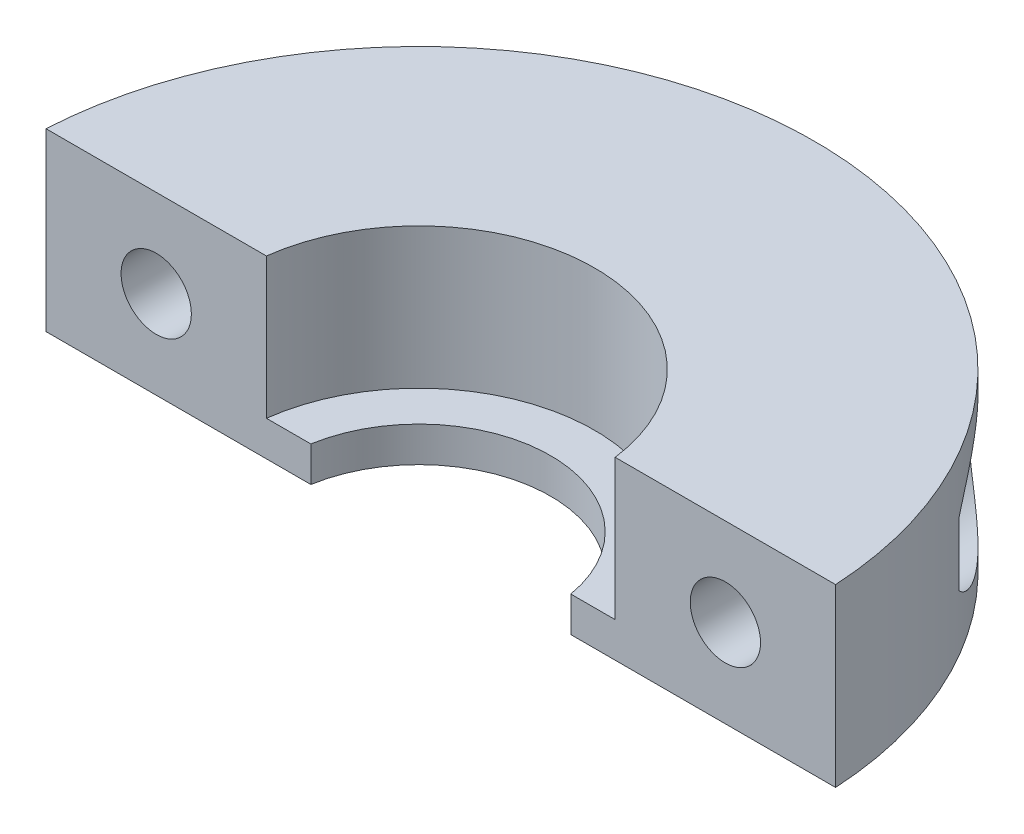
ISO-10303-21;
HEADER;
FILE_DESCRIPTION(('STEP AP214'),'2;1');
FILE_NAME('part.step','',(''),(''),'','','');
FILE_SCHEMA(('AUTOMOTIVE_DESIGN { 1 0 10303 214 1 1 1 1 }'));
ENDSEC;
DATA;
#1=APPLICATION_CONTEXT('core data for automotive mechanical design processes');
#2=APPLICATION_PROTOCOL_DEFINITION('international standard','automotive_design',2000,#1);
#3=PRODUCT_CONTEXT('',#1,'mechanical');
#4=PRODUCT('Part','Part','',(#3));
#5=PRODUCT_RELATED_PRODUCT_CATEGORY('part','',(#4));
#6=PRODUCT_DEFINITION_FORMATION('','',#4);
#7=PRODUCT_DEFINITION_CONTEXT('part definition',#1,'design');
#8=PRODUCT_DEFINITION('design','',#6,#7);
#9=PRODUCT_DEFINITION_SHAPE('','',#8);
#10=(LENGTH_UNIT() NAMED_UNIT(*) SI_UNIT(.MILLI.,.METRE.));
#11=(NAMED_UNIT(*) PLANE_ANGLE_UNIT() SI_UNIT($,.RADIAN.));
#12=(NAMED_UNIT(*) SI_UNIT($,.STERADIAN.) SOLID_ANGLE_UNIT());
#13=UNCERTAINTY_MEASURE_WITH_UNIT(LENGTH_MEASURE(1.E-05),#10,'distance_accuracy_value','');
#14=(GEOMETRIC_REPRESENTATION_CONTEXT(3) GLOBAL_UNCERTAINTY_ASSIGNED_CONTEXT((#13)) GLOBAL_UNIT_ASSIGNED_CONTEXT((#10,
#11,#12)) REPRESENTATION_CONTEXT('',''));
#15=CARTESIAN_POINT('',(0.,0.,0.));
#16=DIRECTION('',(0.,0.,1.));
#17=DIRECTION('',(1.,0.,0.));
#18=AXIS2_PLACEMENT_3D('',#15,#16,#17);
#19=CARTESIAN_POINT('',(0.,8.,0.));
#20=DIRECTION('',(0.,1.,0.));
#21=DIRECTION('',(0.,0.,1.));
#22=AXIS2_PLACEMENT_3D('',#19,#20,#21);
#23=PLANE('',#22);
#24=DIRECTION('',(-1.,0.,0.));
#25=VECTOR('',#24,1.);
#26=CARTESIAN_POINT('',(-20.,8.,-1.));
#27=LINE('',#26,#25);
#28=CARTESIAN_POINT('',(17.9722007556114,8.,-1.));
#29=VERTEX_POINT('',#28);
#30=CARTESIAN_POINT('',(7.93725393319377,8.,-1.));
#31=VERTEX_POINT('',#30);
#32=EDGE_CURVE('E187',#29,#31,#27,.T.);
#33=ORIENTED_EDGE('',*,*,#32,.F.);
#34=CARTESIAN_POINT('',(0.,8.,0.));
#35=DIRECTION('',(0.,1.,0.));
#36=DIRECTION('',(0.,0.,1.));
#37=AXIS2_PLACEMENT_3D('',#34,#35,#36);
#38=CIRCLE('',#37,18.);
#39=CARTESIAN_POINT('',(-17.9722007556114,8.,-1.));
#40=VERTEX_POINT('',#39);
#41=EDGE_CURVE('E212',#29,#40,#38,.T.);
#42=ORIENTED_EDGE('',*,*,#41,.T.);
#43=CARTESIAN_POINT('',(-7.93725393319377,8.,-1.));
#44=VERTEX_POINT('',#43);
#45=EDGE_CURVE('E182',#44,#40,#27,.T.);
#46=ORIENTED_EDGE('',*,*,#45,.F.);
#47=CARTESIAN_POINT('',(0.,8.,0.));
#48=DIRECTION('',(0.,1.,0.));
#49=DIRECTION('',(0.,0.,1.));
#50=AXIS2_PLACEMENT_3D('',#47,#48,#49);
#51=CIRCLE('',#50,8.);
#52=EDGE_CURVE('E206',#31,#44,#51,.T.);
#53=ORIENTED_EDGE('',*,*,#52,.F.);
#54=EDGE_LOOP('',(#33,#42,#46,#53));
#55=FACE_BOUND('',#54,.T.);
#56=ADVANCED_FACE('F32',(#55),#23,.T.);
#57=CARTESIAN_POINT('',(0.,0.,0.));
#58=DIRECTION('',(0.,1.,0.));
#59=DIRECTION('',(0.,0.,1.));
#60=AXIS2_PLACEMENT_3D('',#57,#58,#59);
#61=PLANE('',#60);
#62=CARTESIAN_POINT('',(0.,0.,0.));
#63=DIRECTION('',(0.,1.,0.));
#64=DIRECTION('',(0.,0.,1.));
#65=AXIS2_PLACEMENT_3D('',#62,#63,#64);
#66=CIRCLE('',#65,18.);
#67=CARTESIAN_POINT('',(17.9722007556114,0.,-1.));
#68=VERTEX_POINT('',#67);
#69=CARTESIAN_POINT('',(-17.9722007556114,0.,-1.));
#70=VERTEX_POINT('',#69);
#71=EDGE_CURVE('E211',#68,#70,#66,.T.);
#72=ORIENTED_EDGE('',*,*,#71,.F.);
#73=DIRECTION('',(-1.,0.,0.));
#74=VECTOR('',#73,1.);
#75=CARTESIAN_POINT('',(-20.,0.,-1.));
#76=LINE('',#75,#74);
#77=CARTESIAN_POINT('',(5.91607978309962,0.,-1.));
#78=VERTEX_POINT('',#77);
#79=EDGE_CURVE('E186',#68,#78,#76,.T.);
#80=ORIENTED_EDGE('',*,*,#79,.T.);
#81=CARTESIAN_POINT('',(0.,0.,0.));
#82=DIRECTION('',(0.,1.,0.));
#83=DIRECTION('',(0.,0.,1.));
#84=AXIS2_PLACEMENT_3D('',#81,#82,#83);
#85=CIRCLE('',#84,6.);
#86=CARTESIAN_POINT('',(-5.91607978309962,0.,-1.));
#87=VERTEX_POINT('',#86);
#88=EDGE_CURVE('E202',#78,#87,#85,.T.);
#89=ORIENTED_EDGE('',*,*,#88,.T.);
#90=EDGE_CURVE('E183',#87,#70,#76,.T.);
#91=ORIENTED_EDGE('',*,*,#90,.T.);
#92=EDGE_LOOP('',(#72,#80,#89,#91));
#93=FACE_BOUND('',#92,.T.);
#94=ADVANCED_FACE('F124',(#93),#61,.F.);
#95=CARTESIAN_POINT('',(0.,8.,0.));
#96=DIRECTION('',(0.,-1.,0.));
#97=DIRECTION('',(0.,0.,-1.));
#98=AXIS2_PLACEMENT_3D('',#95,#96,#97);
#99=CYLINDRICAL_SURFACE('',#98,18.);
#100=DIRECTION('',(0.,-1.,0.));
#101=VECTOR('',#100,1.);
#102=CARTESIAN_POINT('',(15.5884572681199,8.,-9.));
#103=LINE('',#102,#101);
#104=CARTESIAN_POINT('',(15.5884572681199,5.43647718008887,-9.));
#105=VERTEX_POINT('',#104);
#106=CARTESIAN_POINT('',(15.5884572681199,2.56352281991113,-9.));
#107=VERTEX_POINT('',#106);
#108=EDGE_CURVE('E100',#105,#107,#103,.T.);
#109=ORIENTED_EDGE('',*,*,#108,.F.);
#110=CARTESIAN_POINT('',(15.5884572681199,2.56352281991113,-9.));
#111=CARTESIAN_POINT('',(15.5649651770552,2.52046222519624,-9.04069159192705));
#112=CARTESIAN_POINT('',(15.5407733203554,2.47860756697143,-9.08222295354555));
#113=CARTESIAN_POINT('',(15.4911048788267,2.39716814864524,-9.1666820942712));
#114=CARTESIAN_POINT('',(15.465628835948,2.35758244582849,-9.20960928164386));
#115=CARTESIAN_POINT('',(15.3875216072785,2.24211958036131,-9.33993643477878));
#116=CARTESIAN_POINT('',(15.3331153979724,2.16936371164468,-9.42904881982839));
#117=CARTESIAN_POINT('',(15.2202507440993,2.03141446708927,-9.61016905731066));
#118=CARTESIAN_POINT('',(15.1617986315061,1.96620968278379,-9.7021722675498));
#119=CARTESIAN_POINT('',(15.0410785220971,1.84254664328878,-9.88828999513382));
#120=CARTESIAN_POINT('',(14.9788077084984,1.78409346218517,-9.9824060377223));
#121=CARTESIAN_POINT('',(14.8162589210875,1.6438056376647,-10.2229835183654));
#122=CARTESIAN_POINT('',(14.7135607548742,1.5663157950125,-10.3703591344364));
#123=CARTESIAN_POINT('',(14.5004236316084,1.42568226063934,-10.6663496453093));
#124=CARTESIAN_POINT('',(14.3899831070043,1.36254148513302,-10.8149647856733));
#125=CARTESIAN_POINT('',(14.1615166864593,1.25047440723539,-11.1124577672634));
#126=CARTESIAN_POINT('',(14.0434702759297,1.20158869619187,-11.2613351672845));
#127=CARTESIAN_POINT('',(13.8005951287262,1.11886190396239,-11.5576924577582));
#128=CARTESIAN_POINT('',(13.6757684369314,1.08501631475726,-11.7051727539801));
#129=CARTESIAN_POINT('',(13.44636842676,1.03874935894294,-11.9674124398081));
#130=CARTESIAN_POINT('',(13.3429307767608,1.02334830990902,-12.0826442178997));
#131=CARTESIAN_POINT('',(13.1326326985348,1.00341798940374,-12.310890554039));
#132=CARTESIAN_POINT('',(13.0257729845453,0.998886464090378,-12.423905566921));
#133=CARTESIAN_POINT('',(12.8094726149605,1.00157246187083,-12.646796159113));
#134=CARTESIAN_POINT('',(12.7000389864422,1.00876099166657,-12.7566788035054));
#135=CARTESIAN_POINT('',(12.4792132271642,1.03583773328365,-12.9727840347959));
#136=CARTESIAN_POINT('',(12.3678217182956,1.05572198094079,-13.0790077532644));
#137=CARTESIAN_POINT('',(12.0906341502741,1.12211137622996,-13.3366909955897));
#138=CARTESIAN_POINT('',(11.9242462037354,1.17679255479843,-13.485543571334));
#139=CARTESIAN_POINT('',(11.5946164625392,1.3200201914222,-13.7699714509366));
#140=CARTESIAN_POINT('',(11.4313716396406,1.40853214348646,-13.9055601070489));
#141=CARTESIAN_POINT('',(11.1468891493214,1.60102042177289,-14.1341204820303));
#142=CARTESIAN_POINT('',(11.0237407784989,1.69844948936693,-14.2302113736173));
#143=CARTESIAN_POINT('',(10.7893013606776,1.91755640908782,-14.4087689272405));
#144=CARTESIAN_POINT('',(10.6780067921748,2.03922702857508,-14.4912396395636));
#145=CARTESIAN_POINT('',(10.524151229066,2.23945704003109,-14.6029574003045));
#146=CARTESIAN_POINT('',(10.4748341550893,2.3095495802291,-14.6383447728542));
#147=CARTESIAN_POINT('',(10.3815833785814,2.45520459862773,-14.7046245329344));
#148=CARTESIAN_POINT('',(10.3376467481675,2.53076406594938,-14.7355193669066));
#149=CARTESIAN_POINT('',(10.2559536439394,2.68684611591195,-14.7924948379578));
#150=CARTESIAN_POINT('',(10.2181946439786,2.76736665124555,-14.8185774434054));
#151=CARTESIAN_POINT('',(10.1495799674729,2.9326807590766,-14.8656567118412));
#152=CARTESIAN_POINT('',(10.118722904599,3.01747346926143,-14.8866543962611));
#153=CARTESIAN_POINT('',(10.0455481559172,3.2513860957534,-14.9362018066272));
#154=CARTESIAN_POINT('',(10.0103630326375,3.40392655522872,-14.9597249816349));
#155=CARTESIAN_POINT('',(9.96426726479546,3.71411004810127,-14.9904694157942));
#156=CARTESIAN_POINT('',(9.95334067175385,3.8717496599071,-14.9977013854488));
#157=CARTESIAN_POINT('',(9.9562535229001,4.1717461883872,-14.9957656609021));
#158=CARTESIAN_POINT('',(9.96785046788384,4.31413975936411,-14.988082943633));
#159=CARTESIAN_POINT('',(10.0108055810424,4.59450070559842,-14.9594261775858));
#160=CARTESIAN_POINT('',(10.0421604995662,4.73246880480516,-14.9384543145087));
#161=CARTESIAN_POINT('',(10.1228374243636,4.99993316167132,-14.8839007047995));
#162=CARTESIAN_POINT('',(10.1721087895619,5.12945209590661,-14.8503544915778));
#163=CARTESIAN_POINT('',(10.2862135493632,5.37756926652243,-14.7715469853013));
#164=CARTESIAN_POINT('',(10.3510504136634,5.49616505986433,-14.7262830800854));
#165=CARTESIAN_POINT('',(10.4987171789665,5.72868568661747,-14.6214123725992));
#166=CARTESIAN_POINT('',(10.5825208880315,5.8416223703557,-14.5609944537883));
#167=CARTESIAN_POINT('',(10.7612197867177,6.05122434706158,-14.4294304141324));
#168=CARTESIAN_POINT('',(10.85611916167,6.14788346629769,-14.3582802420823));
#169=CARTESIAN_POINT('',(11.0678320108849,6.33721660280216,-14.1958906025591));
#170=CARTESIAN_POINT('',(11.1858365585873,6.42733186317721,-14.1032334273459));
#171=CARTESIAN_POINT('',(11.4277416902296,6.58636921890822,-13.9079443204715));
#172=CARTESIAN_POINT('',(11.5516469248595,6.65527426697317,-13.8053044521483));
#173=CARTESIAN_POINT('',(11.7728895272695,6.75944829852791,-13.6167200379598));
#174=CARTESIAN_POINT('',(11.8697370800189,6.79881124967186,-13.5324111422513));
#175=CARTESIAN_POINT('',(12.0637276121987,6.86647458037641,-13.3597674207456));
#176=CARTESIAN_POINT('',(12.1608706956016,6.89477046238046,-13.2714309744377));
#177=CARTESIAN_POINT('',(12.4515023793112,6.96419983156018,-13.0011457130009));
#178=CARTESIAN_POINT('',(12.644065507968,6.98981792704667,-12.8140294580009));
#179=CARTESIAN_POINT('',(12.957996595144,7.00263130101099,-12.4949050573807));
#180=CARTESIAN_POINT('',(13.0816893936268,6.99979182518448,-12.3653316073228));
#181=CARTESIAN_POINT('',(13.3246754489903,6.97959612786812,-12.1030948999819));
#182=CARTESIAN_POINT('',(13.4439670981651,6.96223465536593,-11.9704305419275));
#183=CARTESIAN_POINT('',(13.6777099970671,6.91403261299332,-11.7026476697779));
#184=CARTESIAN_POINT('',(13.7921459447096,6.88315246762,-11.5675230750264));
#185=CARTESIAN_POINT('',(14.0153099271772,6.80873575251785,-11.2961030139513));
#186=CARTESIAN_POINT('',(14.1240389163351,6.76520130688606,-11.1598077478547));
#187=CARTESIAN_POINT('',(14.3377244499734,6.6648748542268,-10.8839677963384));
#188=CARTESIAN_POINT('',(14.4425471191819,6.60781457022743,-10.7444170350308));
#189=CARTESIAN_POINT('',(14.6455077705701,6.48104588869521,-10.4660771300628));
#190=CARTESIAN_POINT('',(14.7436427778485,6.41133191223213,-10.3272883502732));
#191=CARTESIAN_POINT('',(14.9321818151995,6.25926313456811,-10.0527370568299));
#192=CARTESIAN_POINT('',(15.0226256918055,6.17698056140175,-9.91696203085204));
#193=CARTESIAN_POINT('',(15.1956311174324,5.99845046531284,-9.64976880445506));
#194=CARTESIAN_POINT('',(15.2782017385461,5.9022193452551,-9.51834570632635));
#195=CARTESIAN_POINT('',(15.3976867156553,5.74261976951173,-9.32295910203412));
#196=CARTESIAN_POINT('',(15.4378488879993,5.68501061164449,-9.25626966507231));
#197=CARTESIAN_POINT('',(15.5153597146371,5.564688815459,-9.12575626599012));
#198=CARTESIAN_POINT('',(15.5527047104289,5.50196975369317,-9.0619360719854));
#199=CARTESIAN_POINT('',(15.5884572681199,5.43647718008887,-9.));
#200=B_SPLINE_CURVE_WITH_KNOTS('',3,(#110,#111,#112,#113,#114,#115,#116,#117,#118,#119,#120,
#121,#122,#123,#124,#125,#126,#127,#128,#129,#130,#131,#132,#133,#134,#135,#136,#137,#138,#139,
#140,#141,#142,#143,#144,#145,#146,#147,#148,#149,#150,#151,#152,#153,#154,#155,#156,#157,#158,
#159,#160,#161,#162,#163,#164,#165,#166,#167,#168,#169,#170,#171,#172,#173,#174,#175,#176,#177,
#178,#179,#180,#181,#182,#183,#184,#185,#186,#187,#188,#189,#190,#191,#192,#193,#194,#195,#196,
#197,#198,#199),.UNSPECIFIED.,.F.,.F.,(4,2,2,2,2,2,2,2,2,2,2,2,2,2,2,2,2,2,2,2,2,2,2,2,2,2,2,2,
2,2,2,2,2,2,2,2,2,2,2,2,2,2,2,2,4),(0.,0.191145376740659,0.382210751142034,0.763567978904147,
1.14434130578034,1.52539896149599,2.11151485641769,2.69774976355137,3.28563803067225,
3.87334996929384,4.33979147496568,4.80613625364155,5.27132912910316,5.73637682177805,
6.42338027506107,7.10968487506112,7.65989354277682,8.20993829698318,8.48774954863245,
8.7654089451854,9.04295451638813,9.32044428938972,9.79248290338163,10.264211089247,
10.6913674886841,11.1184536508036,11.5443419140897,11.9703252001974,12.427698153214,
12.8852441891936,13.4083970980038,13.9319693893607,14.3343361249692,14.7368662092885,
15.5424513811126,16.0793535670102,16.6164499754673,17.1551293429133,17.6937183420946,
18.2440462792695,18.7946174444239,19.3421360551386,19.8890159549493,20.1793635147876,
20.4700818629869),.UNSPECIFIED.);
#201=EDGE_CURVE('E46',#107,#105,#200,.T.);
#202=ORIENTED_EDGE('',*,*,#201,.F.);
#203=EDGE_LOOP('',(#109,#202));
#204=FACE_BOUND('',#203,.T.);
#205=DIRECTION('',(0.,-1.,0.));
#206=VECTOR('',#205,1.);
#207=CARTESIAN_POINT('',(-15.5884572681199,8.,-9.));
#208=LINE('',#207,#206);
#209=CARTESIAN_POINT('',(-15.5884572681199,2.56352281991113,-9.));
#210=VERTEX_POINT('',#209);
#211=CARTESIAN_POINT('',(-15.5884572681199,5.43647718008887,-9.));
#212=VERTEX_POINT('',#211);
#213=EDGE_CURVE('E173',#210,#212,#208,.F.);
#214=ORIENTED_EDGE('',*,*,#213,.F.);
#215=CARTESIAN_POINT('',(-15.5884572681199,5.43647718008887,-9.));
#216=CARTESIAN_POINT('',(-15.5649651770552,5.47953777480376,-9.04069159192705));
#217=CARTESIAN_POINT('',(-15.5407733203554,5.52139243302857,-9.08222295354555));
#218=CARTESIAN_POINT('',(-15.4911048788267,5.60283185135476,-9.1666820942712));
#219=CARTESIAN_POINT('',(-15.465628835948,5.64241755417151,-9.20960928164386));
#220=CARTESIAN_POINT('',(-15.3875216072785,5.75788041963869,-9.33993643477878));
#221=CARTESIAN_POINT('',(-15.3331153979724,5.83063628835532,-9.4290488198284));
#222=CARTESIAN_POINT('',(-15.2202507440993,5.96858553291073,-9.61016905731066));
#223=CARTESIAN_POINT('',(-15.1617986315061,6.03379031721621,-9.7021722675498));
#224=CARTESIAN_POINT('',(-15.0410785220971,6.15745335671122,-9.88828999513382));
#225=CARTESIAN_POINT('',(-14.9788077084984,6.21590653781484,-9.9824060377223));
#226=CARTESIAN_POINT('',(-14.8162589210875,6.35619436233531,-10.2229835183654));
#227=CARTESIAN_POINT('',(-14.7135607548742,6.4336842049875,-10.3703591344364));
#228=CARTESIAN_POINT('',(-14.5004236316084,6.57431773936066,-10.6663496453093));
#229=CARTESIAN_POINT('',(-14.3899831070043,6.63745851486698,-10.8149647856734));
#230=CARTESIAN_POINT('',(-14.1615166864593,6.74952559276461,-11.1124577672634));
#231=CARTESIAN_POINT('',(-14.0434702759297,6.79841130380813,-11.2613351672845));
#232=CARTESIAN_POINT('',(-13.8005951287262,6.88113809603761,-11.5576924577582));
#233=CARTESIAN_POINT('',(-13.6757684369314,6.91498368524274,-11.7051727539801));
#234=CARTESIAN_POINT('',(-13.44636842676,6.96125064105706,-11.9674124398081));
#235=CARTESIAN_POINT('',(-13.3429307767608,6.97665169009098,-12.0826442178997));
#236=CARTESIAN_POINT('',(-13.1326326985348,6.99658201059626,-12.310890554039));
#237=CARTESIAN_POINT('',(-13.0257729845453,7.00111353590962,-12.423905566921));
#238=CARTESIAN_POINT('',(-12.8094726149605,6.99842753812918,-12.646796159113));
#239=CARTESIAN_POINT('',(-12.7000389864422,6.99123900833343,-12.7566788035054));
#240=CARTESIAN_POINT('',(-12.4792132271642,6.96416226671635,-12.9727840347959));
#241=CARTESIAN_POINT('',(-12.3678217182956,6.94427801905921,-13.0790077532644));
#242=CARTESIAN_POINT('',(-12.0906341502741,6.87788862377004,-13.3366909955897));
#243=CARTESIAN_POINT('',(-11.9242462037354,6.82320744520157,-13.485543571334));
#244=CARTESIAN_POINT('',(-11.5946164625392,6.6799798085778,-13.7699714509366));
#245=CARTESIAN_POINT('',(-11.4313716396406,6.59146785651354,-13.9055601070489));
#246=CARTESIAN_POINT('',(-11.1468891493214,6.39897957822711,-14.1341204820303));
#247=CARTESIAN_POINT('',(-11.0237407784989,6.30155051063307,-14.2302113736173));
#248=CARTESIAN_POINT('',(-10.7893013606776,6.08244359091218,-14.4087689272405));
#249=CARTESIAN_POINT('',(-10.6780067921748,5.96077297142492,-14.4912396395636));
#250=CARTESIAN_POINT('',(-10.524151229066,5.76054295996891,-14.6029574003045));
#251=CARTESIAN_POINT('',(-10.4748341550893,5.69045041977091,-14.6383447728542));
#252=CARTESIAN_POINT('',(-10.3815833785814,5.54479540137227,-14.7046245329344));
#253=CARTESIAN_POINT('',(-10.3376467481675,5.46923593405061,-14.7355193669066));
#254=CARTESIAN_POINT('',(-10.2559536439394,5.31315388408805,-14.7924948379578));
#255=CARTESIAN_POINT('',(-10.2181946439786,5.23263334875445,-14.8185774434054));
#256=CARTESIAN_POINT('',(-10.1495799674729,5.06731924092341,-14.8656567118412));
#257=CARTESIAN_POINT('',(-10.118722904599,4.98252653073857,-14.8866543962611));
#258=CARTESIAN_POINT('',(-10.0455481559172,4.74861390424661,-14.9362018066272));
#259=CARTESIAN_POINT('',(-10.0103630326375,4.59607344477128,-14.9597249816349));
#260=CARTESIAN_POINT('',(-9.96426726479546,4.28588995189873,-14.9904694157942));
#261=CARTESIAN_POINT('',(-9.95334067175385,4.1282503400929,-14.9977013854488));
#262=CARTESIAN_POINT('',(-9.95625352290009,3.8282538116128,-14.9957656609021));
#263=CARTESIAN_POINT('',(-9.96785046788384,3.68586024063589,-14.988082943633));
#264=CARTESIAN_POINT('',(-10.0108055810424,3.40549929440158,-14.9594261775858));
#265=CARTESIAN_POINT('',(-10.0421604995662,3.26753119519483,-14.9384543145087));
#266=CARTESIAN_POINT('',(-10.1228374243636,3.00006683832868,-14.8839007047995));
#267=CARTESIAN_POINT('',(-10.1721087895619,2.87054790409339,-14.8503544915778));
#268=CARTESIAN_POINT('',(-10.2862135493632,2.62243073347757,-14.7715469853013));
#269=CARTESIAN_POINT('',(-10.3510504136634,2.50383494013566,-14.7262830800854));
#270=CARTESIAN_POINT('',(-10.4987171789665,2.27131431338252,-14.6214123725992));
#271=CARTESIAN_POINT('',(-10.5825208880315,2.1583776296443,-14.5609944537883));
#272=CARTESIAN_POINT('',(-10.7612197867177,1.94877565293842,-14.4294304141324));
#273=CARTESIAN_POINT('',(-10.85611916167,1.85211653370231,-14.3582802420823));
#274=CARTESIAN_POINT('',(-11.0678320108849,1.66278339719784,-14.1958906025591));
#275=CARTESIAN_POINT('',(-11.1858365585873,1.57266813682278,-14.1032334273459));
#276=CARTESIAN_POINT('',(-11.4277416902296,1.41363078109177,-13.9079443204715));
#277=CARTESIAN_POINT('',(-11.5516469248595,1.34472573302683,-13.8053044521483));
#278=CARTESIAN_POINT('',(-11.7728895272695,1.24055170147209,-13.6167200379598));
#279=CARTESIAN_POINT('',(-11.8697370800189,1.20118875032814,-13.5324111422513));
#280=CARTESIAN_POINT('',(-12.0637276121987,1.13352541962359,-13.3597674207456));
#281=CARTESIAN_POINT('',(-12.1608706956017,1.10522953761953,-13.2714309744377));
#282=CARTESIAN_POINT('',(-12.4515023793112,1.03580016843982,-13.0011457130009));
#283=CARTESIAN_POINT('',(-12.644065507968,1.01018207295333,-12.8140294580009));
#284=CARTESIAN_POINT('',(-12.957996595144,0.997368698989005,-12.4949050573807));
#285=CARTESIAN_POINT('',(-13.0816893936268,1.00020817481552,-12.3653316073228));
#286=CARTESIAN_POINT('',(-13.3246754489903,1.02040387213188,-12.1030948999818));
#287=CARTESIAN_POINT('',(-13.4439670981651,1.03776534463407,-11.9704305419275));
#288=CARTESIAN_POINT('',(-13.6777099970671,1.08596738700668,-11.7026476697779));
#289=CARTESIAN_POINT('',(-13.7921459447096,1.11684753237999,-11.5675230750264));
#290=CARTESIAN_POINT('',(-14.0153099271772,1.19126424748214,-11.2961030139513));
#291=CARTESIAN_POINT('',(-14.1240389163351,1.23479869311394,-11.1598077478547));
#292=CARTESIAN_POINT('',(-14.3377244499734,1.3351251457732,-10.8839677963384));
#293=CARTESIAN_POINT('',(-14.4425471191819,1.39218542977257,-10.7444170350308));
#294=CARTESIAN_POINT('',(-14.6455077705701,1.51895411130479,-10.4660771300628));
#295=CARTESIAN_POINT('',(-14.7436427778485,1.58866808776787,-10.3272883502732));
#296=CARTESIAN_POINT('',(-14.9321818151995,1.74073686543189,-10.0527370568299));
#297=CARTESIAN_POINT('',(-15.0226256918055,1.82301943859825,-9.91696203085204));
#298=CARTESIAN_POINT('',(-15.1956311174324,2.00154953468716,-9.64976880445505));
#299=CARTESIAN_POINT('',(-15.2782017385461,2.0977806547449,-9.51834570632634));
#300=CARTESIAN_POINT('',(-15.3976867156553,2.25738023048827,-9.32295910203412));
#301=CARTESIAN_POINT('',(-15.4378488879993,2.31498938835551,-9.25626966507231));
#302=CARTESIAN_POINT('',(-15.5153597146371,2.435311184541,-9.12575626599013));
#303=CARTESIAN_POINT('',(-15.5527047104289,2.49803024630683,-9.06193607198541));
#304=CARTESIAN_POINT('',(-15.5884572681199,2.56352281991113,-9.));
#305=B_SPLINE_CURVE_WITH_KNOTS('',3,(#215,#216,#217,#218,#219,#220,#221,#222,#223,#224,#225,
#226,#227,#228,#229,#230,#231,#232,#233,#234,#235,#236,#237,#238,#239,#240,#241,#242,#243,#244,
#245,#246,#247,#248,#249,#250,#251,#252,#253,#254,#255,#256,#257,#258,#259,#260,#261,#262,#263,
#264,#265,#266,#267,#268,#269,#270,#271,#272,#273,#274,#275,#276,#277,#278,#279,#280,#281,#282,
#283,#284,#285,#286,#287,#288,#289,#290,#291,#292,#293,#294,#295,#296,#297,#298,#299,#300,#301,
#302,#303,#304),.UNSPECIFIED.,.F.,.F.,(4,2,2,2,2,2,2,2,2,2,2,2,2,2,2,2,2,2,2,2,2,2,2,2,2,2,2,2,
2,2,2,2,2,2,2,2,2,2,2,2,2,2,2,2,4),(0.,0.19114537674066,0.382210751142032,0.763567978904148,
1.14434130578034,1.525398961496,2.11151485641769,2.69774976355138,3.28563803067225,
3.87334996929384,4.33979147496568,4.80613625364155,5.27132912910316,5.73637682177805,
6.42338027506107,7.10968487506112,7.65989354277682,8.20993829698318,8.48774954863245,
8.7654089451854,9.04295451638813,9.32044428938972,9.79248290338163,10.264211089247,
10.6913674886841,11.1184536508036,11.5443419140897,11.9703252001974,12.427698153214,
12.8852441891936,13.4083970980038,13.9319693893607,14.3343361249692,14.7368662092885,
15.5424513811126,16.0793535670102,16.6164499754673,17.1551293429133,17.6937183420946,
18.2440462792695,18.7946174444239,19.3421360551386,19.8890159549493,20.1793635147876,
20.4700818629869),.UNSPECIFIED.);
#306=EDGE_CURVE('E53',#212,#210,#305,.T.);
#307=ORIENTED_EDGE('',*,*,#306,.F.);
#308=EDGE_LOOP('',(#214,#307));
#309=FACE_BOUND('',#308,.T.);
#310=ORIENTED_EDGE('',*,*,#41,.F.);
#311=DIRECTION('',(0.,-1.,0.));
#312=VECTOR('',#311,1.);
#313=CARTESIAN_POINT('',(17.9722007556114,8.,-1.));
#314=LINE('',#313,#312);
#315=EDGE_CURVE('E199',#29,#68,#314,.T.);
#316=ORIENTED_EDGE('',*,*,#315,.T.);
#317=ORIENTED_EDGE('',*,*,#71,.T.);
#318=DIRECTION('',(0.,-1.,0.));
#319=VECTOR('',#318,1.);
#320=CARTESIAN_POINT('',(-17.9722007556114,8.,-1.));
#321=LINE('',#320,#319);
#322=EDGE_CURVE('E196',#70,#40,#321,.F.);
#323=ORIENTED_EDGE('',*,*,#322,.T.);
#324=EDGE_LOOP('',(#310,#316,#317,#323));
#325=FACE_BOUND('',#324,.T.);
#326=ADVANCED_FACE('F34',(#204,#309,#325),#99,.T.);
#327=CARTESIAN_POINT('',(0.,8.,0.));
#328=DIRECTION('',(0.,-1.,0.));
#329=DIRECTION('',(0.,0.,-1.));
#330=AXIS2_PLACEMENT_3D('',#327,#328,#329);
#331=CYLINDRICAL_SURFACE('',#330,8.);
#332=DIRECTION('',(0.,-1.,0.));
#333=VECTOR('',#332,1.);
#334=CARTESIAN_POINT('',(7.93725393319377,8.,-1.));
#335=LINE('',#334,#333);
#336=CARTESIAN_POINT('',(7.93725393319377,1.6,-1.));
#337=VERTEX_POINT('',#336);
#338=EDGE_CURVE('E194',#31,#337,#335,.T.);
#339=ORIENTED_EDGE('',*,*,#338,.F.);
#340=ORIENTED_EDGE('',*,*,#52,.T.);
#341=DIRECTION('',(0.,-1.,0.));
#342=VECTOR('',#341,1.);
#343=CARTESIAN_POINT('',(-7.93725393319377,8.,-1.));
#344=LINE('',#343,#342);
#345=CARTESIAN_POINT('',(-7.93725393319377,1.6,-1.));
#346=VERTEX_POINT('',#345);
#347=EDGE_CURVE('E191',#346,#44,#344,.F.);
#348=ORIENTED_EDGE('',*,*,#347,.F.);
#349=CARTESIAN_POINT('',(0.,1.6,0.));
#350=DIRECTION('',(0.,1.,0.));
#351=DIRECTION('',(0.,0.,1.));
#352=AXIS2_PLACEMENT_3D('',#349,#350,#351);
#353=CIRCLE('',#352,8.);
#354=EDGE_CURVE('E215',#337,#346,#353,.T.);
#355=ORIENTED_EDGE('',*,*,#354,.F.);
#356=EDGE_LOOP('',(#339,#340,#348,#355));
#357=FACE_BOUND('',#356,.T.);
#358=ADVANCED_FACE('F133',(#357),#331,.F.);
#359=CARTESIAN_POINT('',(0.,1.6,0.));
#360=DIRECTION('',(0.,1.,0.));
#361=DIRECTION('',(0.,0.,1.));
#362=AXIS2_PLACEMENT_3D('',#359,#360,#361);
#363=PLANE('',#362);
#364=DIRECTION('',(-1.,0.,0.));
#365=VECTOR('',#364,1.);
#366=CARTESIAN_POINT('',(0.,1.6,-1.));
#367=LINE('',#366,#365);
#368=CARTESIAN_POINT('',(5.91607978309962,1.6,-1.));
#369=VERTEX_POINT('',#368);
#370=EDGE_CURVE('E192',#337,#369,#367,.T.);
#371=ORIENTED_EDGE('',*,*,#370,.F.);
#372=ORIENTED_EDGE('',*,*,#354,.T.);
#373=CARTESIAN_POINT('',(-5.91607978309962,1.6,-1.));
#374=VERTEX_POINT('',#373);
#375=EDGE_CURVE('E189',#374,#346,#367,.T.);
#376=ORIENTED_EDGE('',*,*,#375,.F.);
#377=CARTESIAN_POINT('',(0.,1.6,0.));
#378=DIRECTION('',(0.,1.,0.));
#379=DIRECTION('',(0.,0.,1.));
#380=AXIS2_PLACEMENT_3D('',#377,#378,#379);
#381=CIRCLE('',#380,6.);
#382=EDGE_CURVE('E203',#369,#374,#381,.T.);
#383=ORIENTED_EDGE('',*,*,#382,.F.);
#384=EDGE_LOOP('',(#371,#372,#376,#383));
#385=FACE_BOUND('',#384,.T.);
#386=ADVANCED_FACE('F136',(#385),#363,.T.);
#387=CARTESIAN_POINT('',(0.,1.6,0.));
#388=DIRECTION('',(0.,-1.,0.));
#389=DIRECTION('',(0.,0.,-1.));
#390=AXIS2_PLACEMENT_3D('',#387,#388,#389);
#391=CYLINDRICAL_SURFACE('',#390,6.);
#392=DIRECTION('',(0.,-1.,0.));
#393=VECTOR('',#392,1.);
#394=CARTESIAN_POINT('',(5.91607978309962,1.6,-1.));
#395=LINE('',#394,#393);
#396=EDGE_CURVE('E11',#369,#78,#395,.T.);
#397=ORIENTED_EDGE('',*,*,#396,.F.);
#398=ORIENTED_EDGE('',*,*,#382,.T.);
#399=DIRECTION('',(0.,-1.,0.));
#400=VECTOR('',#399,1.);
#401=CARTESIAN_POINT('',(-5.91607978309962,1.6,-1.));
#402=LINE('',#401,#400);
#403=EDGE_CURVE('E40',#87,#374,#402,.F.);
#404=ORIENTED_EDGE('',*,*,#403,.F.);
#405=ORIENTED_EDGE('',*,*,#88,.F.);
#406=EDGE_LOOP('',(#397,#398,#404,#405));
#407=FACE_BOUND('',#406,.T.);
#408=ADVANCED_FACE('F140',(#407),#391,.F.);
#409=CARTESIAN_POINT('',(-20.,0.,-1.));
#410=DIRECTION('',(0.,0.,-1.));
#411=DIRECTION('',(-1.,0.,0.));
#412=AXIS2_PLACEMENT_3D('',#409,#410,#411);
#413=PLANE('',#412);
#414=CARTESIAN_POINT('',(-12.9547273444026,4.,-1.));
#415=DIRECTION('',(0.,0.,1.));
#416=DIRECTION('',(1.,0.,0.));
#417=AXIS2_PLACEMENT_3D('',#414,#415,#416);
#418=CIRCLE('',#417,1.6);
#419=CARTESIAN_POINT('',(-11.3547273444026,4.,-1.));
#420=VERTEX_POINT('',#419);
#421=EDGE_CURVE('E179',#420,#420,#418,.T.);
#422=ORIENTED_EDGE('',*,*,#421,.F.);
#423=EDGE_LOOP('',(#422));
#424=FACE_BOUND('',#423,.T.);
#425=ORIENTED_EDGE('',*,*,#90,.F.);
#426=ORIENTED_EDGE('',*,*,#403,.T.);
#427=ORIENTED_EDGE('',*,*,#375,.T.);
#428=ORIENTED_EDGE('',*,*,#347,.T.);
#429=ORIENTED_EDGE('',*,*,#45,.T.);
#430=ORIENTED_EDGE('',*,*,#322,.F.);
#431=EDGE_LOOP('',(#425,#426,#427,#428,#429,#430));
#432=FACE_BOUND('',#431,.T.);
#433=ADVANCED_FACE('F144',(#424,#432),#413,.F.);
#434=CARTESIAN_POINT('',(12.9547273444026,4.,-1.));
#435=DIRECTION('',(0.,0.,1.));
#436=DIRECTION('',(1.,0.,0.));
#437=AXIS2_PLACEMENT_3D('',#434,#435,#436);
#438=CIRCLE('',#437,1.6);
#439=CARTESIAN_POINT('',(14.5547273444026,4.,-1.));
#440=VERTEX_POINT('',#439);
#441=EDGE_CURVE('E176',#440,#440,#438,.T.);
#442=ORIENTED_EDGE('',*,*,#441,.F.);
#443=EDGE_LOOP('',(#442));
#444=FACE_BOUND('',#443,.T.);
#445=ORIENTED_EDGE('',*,*,#32,.T.);
#446=ORIENTED_EDGE('',*,*,#338,.T.);
#447=ORIENTED_EDGE('',*,*,#370,.T.);
#448=ORIENTED_EDGE('',*,*,#396,.T.);
#449=ORIENTED_EDGE('',*,*,#79,.F.);
#450=ORIENTED_EDGE('',*,*,#315,.F.);
#451=EDGE_LOOP('',(#445,#446,#447,#448,#449,#450));
#452=FACE_BOUND('',#451,.T.);
#453=ADVANCED_FACE('F146',(#444,#452),#413,.F.);
#454=CARTESIAN_POINT('',(-12.9547273444026,4.,-18.001));
#455=DIRECTION('',(0.,0.,1.));
#456=DIRECTION('',(1.,0.,0.));
#457=AXIS2_PLACEMENT_3D('',#454,#455,#456);
#458=CYLINDRICAL_SURFACE('',#457,1.6);
#459=CARTESIAN_POINT('',(-12.9547273444026,4.,-9.));
#460=DIRECTION('',(0.,0.,1.));
#461=DIRECTION('',(1.,0.,0.));
#462=AXIS2_PLACEMENT_3D('',#459,#460,#461);
#463=CIRCLE('',#462,1.6);
#464=CARTESIAN_POINT('',(-11.3547273444026,4.,-9.));
#465=VERTEX_POINT('',#464);
#466=EDGE_CURVE('E170',#465,#465,#463,.T.);
#467=ORIENTED_EDGE('',*,*,#466,.F.);
#468=EDGE_LOOP('',(#467));
#469=FACE_BOUND('',#468,.T.);
#470=ORIENTED_EDGE('',*,*,#421,.T.);
#471=EDGE_LOOP('',(#470));
#472=FACE_BOUND('',#471,.T.);
#473=ADVANCED_FACE('F149',(#469,#472),#458,.F.);
#474=CARTESIAN_POINT('',(12.9547273444026,4.,-18.001));
#475=DIRECTION('',(0.,0.,1.));
#476=DIRECTION('',(1.,0.,0.));
#477=AXIS2_PLACEMENT_3D('',#474,#475,#476);
#478=CYLINDRICAL_SURFACE('',#477,1.6);
#479=CARTESIAN_POINT('',(12.9547273444026,4.,-9.));
#480=DIRECTION('',(0.,0.,1.));
#481=DIRECTION('',(1.,0.,0.));
#482=AXIS2_PLACEMENT_3D('',#479,#480,#481);
#483=CIRCLE('',#482,1.6);
#484=CARTESIAN_POINT('',(14.5547273444026,4.,-9.));
#485=VERTEX_POINT('',#484);
#486=EDGE_CURVE('E98',#485,#485,#483,.T.);
#487=ORIENTED_EDGE('',*,*,#486,.F.);
#488=EDGE_LOOP('',(#487));
#489=FACE_BOUND('',#488,.T.);
#490=ORIENTED_EDGE('',*,*,#441,.T.);
#491=EDGE_LOOP('',(#490));
#492=FACE_BOUND('',#491,.T.);
#493=ADVANCED_FACE('F153',(#489,#492),#478,.F.);
#494=CARTESIAN_POINT('',(-12.9547273444026,4.,-18.001));
#495=DIRECTION('',(0.,0.,1.));
#496=DIRECTION('',(1.,0.,0.));
#497=AXIS2_PLACEMENT_3D('',#494,#495,#496);
#498=CYLINDRICAL_SURFACE('',#497,3.);
#499=ORIENTED_EDGE('',*,*,#306,.T.);
#500=CARTESIAN_POINT('',(-12.9547273444026,4.,-9.));
#501=DIRECTION('',(0.,0.,1.));
#502=DIRECTION('',(1.,0.,0.));
#503=AXIS2_PLACEMENT_3D('',#500,#501,#502);
#504=CIRCLE('',#503,3.);
#505=EDGE_CURVE('E167',#210,#212,#504,.T.);
#506=ORIENTED_EDGE('',*,*,#505,.T.);
#507=EDGE_LOOP('',(#499,#506));
#508=FACE_BOUND('',#507,.T.);
#509=ADVANCED_FACE('F157',(#508),#498,.F.);
#510=CARTESIAN_POINT('',(-12.9547273444026,4.,-9.));
#511=DIRECTION('',(0.,0.,1.));
#512=DIRECTION('',(1.,0.,0.));
#513=AXIS2_PLACEMENT_3D('',#510,#511,#512);
#514=PLANE('',#513);
#515=ORIENTED_EDGE('',*,*,#466,.T.);
#516=EDGE_LOOP('',(#515));
#517=FACE_BOUND('',#516,.T.);
#518=ORIENTED_EDGE('',*,*,#213,.T.);
#519=ORIENTED_EDGE('',*,*,#505,.F.);
#520=EDGE_LOOP('',(#518,#519));
#521=FACE_BOUND('',#520,.T.);
#522=ADVANCED_FACE('F121',(#517,#521),#514,.F.);
#523=CARTESIAN_POINT('',(12.9547273444026,4.,-18.001));
#524=DIRECTION('',(0.,0.,1.));
#525=DIRECTION('',(1.,0.,0.));
#526=AXIS2_PLACEMENT_3D('',#523,#524,#525);
#527=CYLINDRICAL_SURFACE('',#526,3.);
#528=ORIENTED_EDGE('',*,*,#201,.T.);
#529=CARTESIAN_POINT('',(12.9547273444026,4.,-9.));
#530=DIRECTION('',(0.,0.,1.));
#531=DIRECTION('',(1.,0.,0.));
#532=AXIS2_PLACEMENT_3D('',#529,#530,#531);
#533=CIRCLE('',#532,3.);
#534=EDGE_CURVE('E93',#105,#107,#533,.T.);
#535=ORIENTED_EDGE('',*,*,#534,.T.);
#536=EDGE_LOOP('',(#528,#535));
#537=FACE_BOUND('',#536,.T.);
#538=ADVANCED_FACE('F95',(#537),#527,.F.);
#539=CARTESIAN_POINT('',(12.9547273444026,4.,-9.));
#540=DIRECTION('',(0.,0.,1.));
#541=DIRECTION('',(1.,0.,0.));
#542=AXIS2_PLACEMENT_3D('',#539,#540,#541);
#543=PLANE('',#542);
#544=ORIENTED_EDGE('',*,*,#486,.T.);
#545=EDGE_LOOP('',(#544));
#546=FACE_BOUND('',#545,.T.);
#547=ORIENTED_EDGE('',*,*,#108,.T.);
#548=ORIENTED_EDGE('',*,*,#534,.F.);
#549=EDGE_LOOP('',(#547,#548));
#550=FACE_BOUND('',#549,.T.);
#551=ADVANCED_FACE('F101',(#546,#550),#543,.F.);
#552=CLOSED_SHELL('',(#56,#94,#326,#358,#386,#408,#433,#453,#473,#493,#509,#522,#538,#551));
#553=MANIFOLD_SOLID_BREP('B2',#552);
#554=ADVANCED_BREP_SHAPE_REPRESENTATION('',(#18,#553),#14);
#555=SHAPE_DEFINITION_REPRESENTATION(#9,#554);
ENDSEC;
END-ISO-10303-21;
